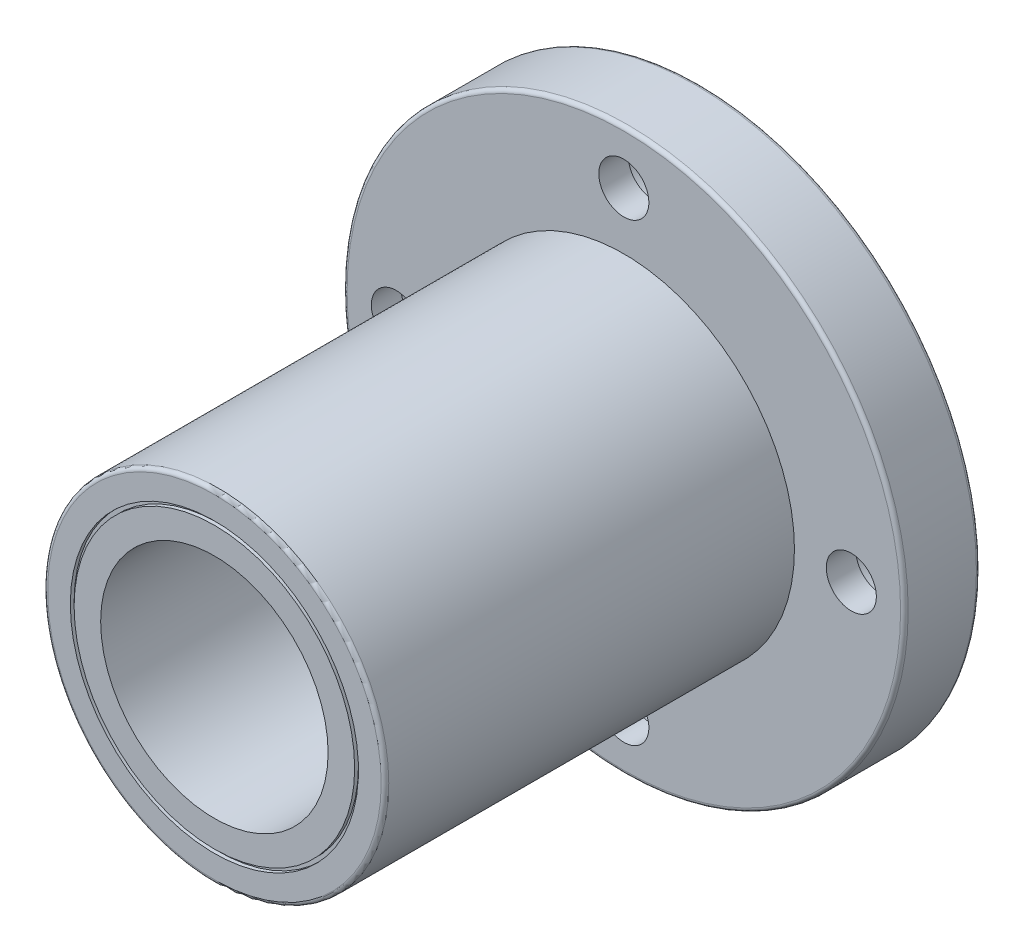
ISO-10303-21;
HEADER;
FILE_DESCRIPTION(('STEP AP214'),'2;1');
FILE_NAME('part.step','',(''),(''),'','','');
FILE_SCHEMA(('AUTOMOTIVE_DESIGN { 1 0 10303 214 1 1 1 1 }'));
ENDSEC;
DATA;
#1=APPLICATION_CONTEXT('core data for automotive mechanical design processes');
#2=APPLICATION_PROTOCOL_DEFINITION('international standard','automotive_design',2000,#1);
#3=PRODUCT_CONTEXT('',#1,'mechanical');
#4=PRODUCT('Part','Part','',(#3));
#5=PRODUCT_RELATED_PRODUCT_CATEGORY('part','',(#4));
#6=PRODUCT_DEFINITION_FORMATION('','',#4);
#7=PRODUCT_DEFINITION_CONTEXT('part definition',#1,'design');
#8=PRODUCT_DEFINITION('design','',#6,#7);
#9=PRODUCT_DEFINITION_SHAPE('','',#8);
#10=(LENGTH_UNIT() NAMED_UNIT(*) SI_UNIT(.MILLI.,.METRE.));
#11=(NAMED_UNIT(*) PLANE_ANGLE_UNIT() SI_UNIT($,.RADIAN.));
#12=(NAMED_UNIT(*) SI_UNIT($,.STERADIAN.) SOLID_ANGLE_UNIT());
#13=UNCERTAINTY_MEASURE_WITH_UNIT(LENGTH_MEASURE(1.E-05),#10,'distance_accuracy_value','');
#14=(GEOMETRIC_REPRESENTATION_CONTEXT(3) GLOBAL_UNCERTAINTY_ASSIGNED_CONTEXT((#13)) GLOBAL_UNIT_ASSIGNED_CONTEXT((#10,
#11,#12)) REPRESENTATION_CONTEXT('',''));
#15=CARTESIAN_POINT('',(0.,0.,0.));
#16=DIRECTION('',(0.,0.,1.));
#17=DIRECTION('',(1.,0.,0.));
#18=AXIS2_PLACEMENT_3D('',#15,#16,#17);
#19=CARTESIAN_POINT('',(0.,22.5,0.));
#20=DIRECTION('',(0.,0.,-1.));
#21=DIRECTION('',(-1.,0.,0.));
#22=AXIS2_PLACEMENT_3D('',#19,#20,#21);
#23=PLANE('',#22);
#24=CARTESIAN_POINT('',(0.,0.,0.));
#25=DIRECTION('',(0.,0.,-1.));
#26=DIRECTION('',(-1.,0.,0.));
#27=AXIS2_PLACEMENT_3D('',#24,#25,#26);
#28=CIRCLE('',#27,36.5);
#29=CARTESIAN_POINT('',(-36.5,0.,0.));
#30=VERTEX_POINT('',#29);
#31=EDGE_CURVE('E72',#30,#30,#28,.T.);
#32=ORIENTED_EDGE('',*,*,#31,.T.);
#33=EDGE_LOOP('',(#32));
#34=FACE_BOUND('',#33,.T.);
#35=CARTESIAN_POINT('',(0.,-30.,0.));
#36=DIRECTION('',(0.,0.,1.));
#37=DIRECTION('',(0.,1.,0.));
#38=AXIS2_PLACEMENT_3D('',#35,#36,#37);
#39=CIRCLE('',#38,5.49999999999998);
#40=CARTESIAN_POINT('',(0.,-24.5,0.));
#41=VERTEX_POINT('',#40);
#42=EDGE_CURVE('E165',#41,#41,#39,.T.);
#43=ORIENTED_EDGE('',*,*,#42,.T.);
#44=EDGE_LOOP('',(#43));
#45=FACE_BOUND('',#44,.T.);
#46=CARTESIAN_POINT('',(0.,30.,0.));
#47=DIRECTION('',(0.,0.,1.));
#48=DIRECTION('',(0.,-1.,0.));
#49=AXIS2_PLACEMENT_3D('',#46,#47,#48);
#50=CIRCLE('',#49,5.49999999999998);
#51=CARTESIAN_POINT('',(0.,24.5,0.));
#52=VERTEX_POINT('',#51);
#53=EDGE_CURVE('E133',#52,#52,#50,.T.);
#54=ORIENTED_EDGE('',*,*,#53,.T.);
#55=EDGE_LOOP('',(#54));
#56=FACE_BOUND('',#55,.T.);
#57=CARTESIAN_POINT('',(0.,0.,0.));
#58=DIRECTION('',(0.,0.,-1.));
#59=DIRECTION('',(-1.,0.,0.));
#60=AXIS2_PLACEMENT_3D('',#57,#58,#59);
#61=CIRCLE('',#60,22.5);
#62=CARTESIAN_POINT('',(-22.5,0.,0.));
#63=VERTEX_POINT('',#62);
#64=EDGE_CURVE('E129',#63,#63,#61,.T.);
#65=ORIENTED_EDGE('',*,*,#64,.F.);
#66=EDGE_LOOP('',(#65));
#67=FACE_BOUND('',#66,.T.);
#68=CARTESIAN_POINT('',(30.,-1.04744440165294E-13,0.));
#69=DIRECTION('',(0.,0.,1.));
#70=DIRECTION('',(-1.,0.,0.));
#71=AXIS2_PLACEMENT_3D('',#68,#69,#70);
#72=CIRCLE('',#71,5.49999999999998);
#73=CARTESIAN_POINT('',(24.5,0.,0.));
#74=VERTEX_POINT('',#73);
#75=EDGE_CURVE('E149',#74,#74,#72,.T.);
#76=ORIENTED_EDGE('',*,*,#75,.T.);
#77=EDGE_LOOP('',(#76));
#78=FACE_BOUND('',#77,.T.);
#79=CARTESIAN_POINT('',(-30.,3.14233320495882E-13,0.));
#80=DIRECTION('',(0.,0.,1.));
#81=DIRECTION('',(1.,0.,0.));
#82=AXIS2_PLACEMENT_3D('',#79,#80,#81);
#83=CIRCLE('',#82,5.49999999999998);
#84=CARTESIAN_POINT('',(-24.5,2.56623878404971E-13,0.));
#85=VERTEX_POINT('',#84);
#86=EDGE_CURVE('E180',#85,#85,#83,.T.);
#87=ORIENTED_EDGE('',*,*,#86,.T.);
#88=EDGE_LOOP('',(#87));
#89=FACE_BOUND('',#88,.T.);
#90=ADVANCED_FACE('F40',(#34,#45,#56,#67,#78,#89),#23,.T.);
#91=CARTESIAN_POINT('',(0.,37.,10.));
#92=DIRECTION('',(0.,0.,1.));
#93=DIRECTION('',(1.,0.,0.));
#94=AXIS2_PLACEMENT_3D('',#91,#92,#93);
#95=PLANE('',#94);
#96=CARTESIAN_POINT('',(0.,0.,10.));
#97=DIRECTION('',(0.,0.,1.));
#98=DIRECTION('',(1.,0.,0.));
#99=AXIS2_PLACEMENT_3D('',#96,#97,#98);
#100=CIRCLE('',#99,36.5);
#101=CARTESIAN_POINT('',(36.5,0.,10.));
#102=VERTEX_POINT('',#101);
#103=EDGE_CURVE('E55',#102,#102,#100,.T.);
#104=ORIENTED_EDGE('',*,*,#103,.T.);
#105=EDGE_LOOP('',(#104));
#106=FACE_BOUND('',#105,.T.);
#107=CARTESIAN_POINT('',(0.,-30.,10.));
#108=DIRECTION('',(0.,0.,1.));
#109=DIRECTION('',(0.,1.,0.));
#110=AXIS2_PLACEMENT_3D('',#107,#108,#109);
#111=CIRCLE('',#110,3.29999999999996);
#112=CARTESIAN_POINT('',(0.,-26.7000000000001,10.));
#113=VERTEX_POINT('',#112);
#114=EDGE_CURVE('E176',#113,#113,#111,.T.);
#115=ORIENTED_EDGE('',*,*,#114,.F.);
#116=EDGE_LOOP('',(#115));
#117=FACE_BOUND('',#116,.T.);
#118=CARTESIAN_POINT('',(0.,30.,10.));
#119=DIRECTION('',(0.,0.,1.));
#120=DIRECTION('',(0.,-1.,0.));
#121=AXIS2_PLACEMENT_3D('',#118,#119,#120);
#122=CIRCLE('',#121,3.29999999999996);
#123=CARTESIAN_POINT('',(0.,26.7000000000001,10.));
#124=VERTEX_POINT('',#123);
#125=EDGE_CURVE('E145',#124,#124,#122,.T.);
#126=ORIENTED_EDGE('',*,*,#125,.F.);
#127=EDGE_LOOP('',(#126));
#128=FACE_BOUND('',#127,.T.);
#129=CARTESIAN_POINT('',(0.,0.,9.99999999999999));
#130=DIRECTION('',(0.,0.,-1.));
#131=DIRECTION('',(-1.,0.,0.));
#132=AXIS2_PLACEMENT_3D('',#129,#130,#131);
#133=CIRCLE('',#132,22.5);
#134=CARTESIAN_POINT('',(-22.5,0.,9.99999999999999));
#135=VERTEX_POINT('',#134);
#136=EDGE_CURVE('E76',#135,#135,#133,.T.);
#137=ORIENTED_EDGE('',*,*,#136,.T.);
#138=EDGE_LOOP('',(#137));
#139=FACE_BOUND('',#138,.T.);
#140=CARTESIAN_POINT('',(30.,-1.04744440165294E-13,10.));
#141=DIRECTION('',(0.,0.,1.));
#142=DIRECTION('',(-1.,0.,0.));
#143=AXIS2_PLACEMENT_3D('',#140,#141,#142);
#144=CIRCLE('',#143,3.29999999999996);
#145=CARTESIAN_POINT('',(26.7000000000001,0.,10.));
#146=VERTEX_POINT('',#145);
#147=EDGE_CURVE('E161',#146,#146,#144,.T.);
#148=ORIENTED_EDGE('',*,*,#147,.F.);
#149=EDGE_LOOP('',(#148));
#150=FACE_BOUND('',#149,.T.);
#151=CARTESIAN_POINT('',(-30.,3.14233320495882E-13,10.));
#152=DIRECTION('',(0.,0.,1.));
#153=DIRECTION('',(1.,0.,0.));
#154=AXIS2_PLACEMENT_3D('',#151,#152,#153);
#155=CIRCLE('',#154,3.29999999999996);
#156=CARTESIAN_POINT('',(-26.7000000000001,2.79667655241336E-13,10.));
#157=VERTEX_POINT('',#156);
#158=EDGE_CURVE('E192',#157,#157,#155,.T.);
#159=ORIENTED_EDGE('',*,*,#158,.F.);
#160=EDGE_LOOP('',(#159));
#161=FACE_BOUND('',#160,.T.);
#162=ADVANCED_FACE('F200',(#106,#117,#128,#139,#150,#161),#95,.T.);
#163=CARTESIAN_POINT('',(0.,0.,0.));
#164=DIRECTION('',(0.,0.,-1.));
#165=DIRECTION('',(-1.,0.,0.));
#166=AXIS2_PLACEMENT_3D('',#163,#164,#165);
#167=CYLINDRICAL_SURFACE('',#166,37.);
#168=CARTESIAN_POINT('',(0.,0.,0.500000000000001));
#169=DIRECTION('',(0.,0.,-1.));
#170=DIRECTION('',(-1.,0.,0.));
#171=AXIS2_PLACEMENT_3D('',#168,#169,#170);
#172=CIRCLE('',#171,37.);
#173=CARTESIAN_POINT('',(-37.,0.,0.500000000000001));
#174=VERTEX_POINT('',#173);
#175=EDGE_CURVE('E62',#174,#174,#172,.F.);
#176=ORIENTED_EDGE('',*,*,#175,.T.);
#177=EDGE_LOOP('',(#176));
#178=FACE_BOUND('',#177,.T.);
#179=CARTESIAN_POINT('',(0.,0.,9.5));
#180=DIRECTION('',(0.,0.,1.));
#181=DIRECTION('',(1.,0.,0.));
#182=AXIS2_PLACEMENT_3D('',#179,#180,#181);
#183=CIRCLE('',#182,37.);
#184=CARTESIAN_POINT('',(37.,0.,9.5));
#185=VERTEX_POINT('',#184);
#186=EDGE_CURVE('E68',#185,#185,#183,.F.);
#187=ORIENTED_EDGE('',*,*,#186,.T.);
#188=EDGE_LOOP('',(#187));
#189=FACE_BOUND('',#188,.T.);
#190=ADVANCED_FACE('F202',(#178,#189),#167,.T.);
#191=CARTESIAN_POINT('',(0.,0.,0.));
#192=DIRECTION('',(0.,0.,-1.));
#193=DIRECTION('',(-1.,0.,0.));
#194=AXIS2_PLACEMENT_3D('',#191,#192,#193);
#195=CYLINDRICAL_SURFACE('',#194,22.5);
#196=CARTESIAN_POINT('',(0.,0.,63.5));
#197=DIRECTION('',(0.,0.,1.));
#198=DIRECTION('',(1.,0.,0.));
#199=AXIS2_PLACEMENT_3D('',#196,#197,#198);
#200=CIRCLE('',#199,22.5);
#201=CARTESIAN_POINT('',(22.5,0.,63.5));
#202=VERTEX_POINT('',#201);
#203=EDGE_CURVE('E48',#202,#202,#200,.F.);
#204=ORIENTED_EDGE('',*,*,#203,.T.);
#205=EDGE_LOOP('',(#204));
#206=FACE_BOUND('',#205,.T.);
#207=ORIENTED_EDGE('',*,*,#136,.F.);
#208=EDGE_LOOP('',(#207));
#209=FACE_BOUND('',#208,.T.);
#210=ADVANCED_FACE('F209',(#206,#209),#195,.T.);
#211=CARTESIAN_POINT('',(0.,22.5,64.));
#212=DIRECTION('',(0.,0.,1.));
#213=DIRECTION('',(1.,0.,0.));
#214=AXIS2_PLACEMENT_3D('',#211,#212,#213);
#215=PLANE('',#214);
#216=CARTESIAN_POINT('',(0.,0.,64.));
#217=DIRECTION('',(0.,0.,1.));
#218=DIRECTION('',(1.,0.,0.));
#219=AXIS2_PLACEMENT_3D('',#216,#217,#218);
#220=CIRCLE('',#219,22.);
#221=CARTESIAN_POINT('',(22.,0.,64.));
#222=VERTEX_POINT('',#221);
#223=EDGE_CURVE('E10',#222,#222,#220,.T.);
#224=ORIENTED_EDGE('',*,*,#223,.T.);
#225=EDGE_LOOP('',(#224));
#226=FACE_BOUND('',#225,.T.);
#227=CARTESIAN_POINT('',(0.,0.,64.));
#228=DIRECTION('',(0.,0.,-1.));
#229=DIRECTION('',(-1.,0.,0.));
#230=AXIS2_PLACEMENT_3D('',#227,#228,#229);
#231=CIRCLE('',#230,19.);
#232=CARTESIAN_POINT('',(-19.,0.,64.));
#233=VERTEX_POINT('',#232);
#234=EDGE_CURVE('E80',#233,#233,#231,.T.);
#235=ORIENTED_EDGE('',*,*,#234,.T.);
#236=EDGE_LOOP('',(#235));
#237=FACE_BOUND('',#236,.T.);
#238=ADVANCED_FACE('F466',(#226,#237),#215,.T.);
#239=CARTESIAN_POINT('',(0.,0.,0.));
#240=DIRECTION('',(0.,0.,-1.));
#241=DIRECTION('',(-1.,0.,0.));
#242=AXIS2_PLACEMENT_3D('',#239,#240,#241);
#243=CYLINDRICAL_SURFACE('',#242,19.);
#244=CARTESIAN_POINT('',(0.,0.,63.5));
#245=DIRECTION('',(0.,0.,-1.));
#246=DIRECTION('',(-1.,0.,0.));
#247=AXIS2_PLACEMENT_3D('',#244,#245,#246);
#248=CIRCLE('',#247,19.);
#249=CARTESIAN_POINT('',(-19.,0.,63.5));
#250=VERTEX_POINT('',#249);
#251=EDGE_CURVE('E84',#250,#250,#248,.T.);
#252=ORIENTED_EDGE('',*,*,#251,.T.);
#253=EDGE_LOOP('',(#252));
#254=FACE_BOUND('',#253,.T.);
#255=ORIENTED_EDGE('',*,*,#234,.F.);
#256=EDGE_LOOP('',(#255));
#257=FACE_BOUND('',#256,.T.);
#258=ADVANCED_FACE('F457',(#254,#257),#243,.F.);
#259=CARTESIAN_POINT('',(0.,19.,63.5));
#260=DIRECTION('',(0.,0.,1.));
#261=DIRECTION('',(1.,0.,0.));
#262=AXIS2_PLACEMENT_3D('',#259,#260,#261);
#263=PLANE('',#262);
#264=CARTESIAN_POINT('',(0.,0.,63.5));
#265=DIRECTION('',(0.,0.,-1.));
#266=DIRECTION('',(-1.,0.,0.));
#267=AXIS2_PLACEMENT_3D('',#264,#265,#266);
#268=CIRCLE('',#267,18.5);
#269=CARTESIAN_POINT('',(-18.5,0.,63.5));
#270=VERTEX_POINT('',#269);
#271=EDGE_CURVE('E88',#270,#270,#268,.T.);
#272=ORIENTED_EDGE('',*,*,#271,.T.);
#273=EDGE_LOOP('',(#272));
#274=FACE_BOUND('',#273,.T.);
#275=ORIENTED_EDGE('',*,*,#251,.F.);
#276=EDGE_LOOP('',(#275));
#277=FACE_BOUND('',#276,.T.);
#278=ADVANCED_FACE('F448',(#274,#277),#263,.T.);
#279=CARTESIAN_POINT('',(0.,0.,0.));
#280=DIRECTION('',(0.,0.,-1.));
#281=DIRECTION('',(-1.,0.,0.));
#282=AXIS2_PLACEMENT_3D('',#279,#280,#281);
#283=CYLINDRICAL_SURFACE('',#282,18.5);
#284=CARTESIAN_POINT('',(0.,0.,64.));
#285=DIRECTION('',(0.,0.,-1.));
#286=DIRECTION('',(-1.,0.,0.));
#287=AXIS2_PLACEMENT_3D('',#284,#285,#286);
#288=CIRCLE('',#287,18.5);
#289=CARTESIAN_POINT('',(-18.5,0.,64.));
#290=VERTEX_POINT('',#289);
#291=EDGE_CURVE('E92',#290,#290,#288,.T.);
#292=ORIENTED_EDGE('',*,*,#291,.T.);
#293=EDGE_LOOP('',(#292));
#294=FACE_BOUND('',#293,.T.);
#295=ORIENTED_EDGE('',*,*,#271,.F.);
#296=EDGE_LOOP('',(#295));
#297=FACE_BOUND('',#296,.T.);
#298=ADVANCED_FACE('F440',(#294,#297),#283,.T.);
#299=CARTESIAN_POINT('',(0.,18.5,64.));
#300=DIRECTION('',(0.,0.,1.));
#301=DIRECTION('',(1.,0.,0.));
#302=AXIS2_PLACEMENT_3D('',#299,#300,#301);
#303=PLANE('',#302);
#304=CARTESIAN_POINT('',(0.,0.,64.));
#305=DIRECTION('',(0.,0.,-1.));
#306=DIRECTION('',(-1.,0.,0.));
#307=AXIS2_PLACEMENT_3D('',#304,#305,#306);
#308=CIRCLE('',#307,15.);
#309=CARTESIAN_POINT('',(-15.,0.,64.));
#310=VERTEX_POINT('',#309);
#311=EDGE_CURVE('E96',#310,#310,#308,.T.);
#312=ORIENTED_EDGE('',*,*,#311,.T.);
#313=EDGE_LOOP('',(#312));
#314=FACE_BOUND('',#313,.T.);
#315=ORIENTED_EDGE('',*,*,#291,.F.);
#316=EDGE_LOOP('',(#315));
#317=FACE_BOUND('',#316,.T.);
#318=ADVANCED_FACE('F432',(#314,#317),#303,.T.);
#319=CARTESIAN_POINT('',(0.,0.,0.));
#320=DIRECTION('',(0.,0.,-1.));
#321=DIRECTION('',(-1.,0.,0.));
#322=AXIS2_PLACEMENT_3D('',#319,#320,#321);
#323=CYLINDRICAL_SURFACE('',#322,15.);
#324=CARTESIAN_POINT('',(0.,0.,0.));
#325=DIRECTION('',(0.,0.,-1.));
#326=DIRECTION('',(-1.,0.,0.));
#327=AXIS2_PLACEMENT_3D('',#324,#325,#326);
#328=CIRCLE('',#327,15.);
#329=CARTESIAN_POINT('',(-15.,0.,0.));
#330=VERTEX_POINT('',#329);
#331=EDGE_CURVE('E100',#330,#330,#328,.T.);
#332=ORIENTED_EDGE('',*,*,#331,.T.);
#333=EDGE_LOOP('',(#332));
#334=FACE_BOUND('',#333,.T.);
#335=ORIENTED_EDGE('',*,*,#311,.F.);
#336=EDGE_LOOP('',(#335));
#337=FACE_BOUND('',#336,.T.);
#338=ADVANCED_FACE('F423',(#334,#337),#323,.F.);
#339=CARTESIAN_POINT('',(0.,15.,0.));
#340=DIRECTION('',(0.,0.,-1.));
#341=DIRECTION('',(-1.,0.,0.));
#342=AXIS2_PLACEMENT_3D('',#339,#340,#341);
#343=PLANE('',#342);
#344=CARTESIAN_POINT('',(0.,0.,0.));
#345=DIRECTION('',(0.,0.,-1.));
#346=DIRECTION('',(-1.,0.,0.));
#347=AXIS2_PLACEMENT_3D('',#344,#345,#346);
#348=CIRCLE('',#347,18.5);
#349=CARTESIAN_POINT('',(-18.5,0.,0.));
#350=VERTEX_POINT('',#349);
#351=EDGE_CURVE('E104',#350,#350,#348,.T.);
#352=ORIENTED_EDGE('',*,*,#351,.T.);
#353=EDGE_LOOP('',(#352));
#354=FACE_BOUND('',#353,.T.);
#355=ORIENTED_EDGE('',*,*,#331,.F.);
#356=EDGE_LOOP('',(#355));
#357=FACE_BOUND('',#356,.T.);
#358=ADVANCED_FACE('F414',(#354,#357),#343,.T.);
#359=CARTESIAN_POINT('',(0.,0.,0.));
#360=DIRECTION('',(0.,0.,-1.));
#361=DIRECTION('',(-1.,0.,0.));
#362=AXIS2_PLACEMENT_3D('',#359,#360,#361);
#363=CYLINDRICAL_SURFACE('',#362,18.5);
#364=CARTESIAN_POINT('',(0.,0.,0.5));
#365=DIRECTION('',(0.,0.,-1.));
#366=DIRECTION('',(-1.,0.,0.));
#367=AXIS2_PLACEMENT_3D('',#364,#365,#366);
#368=CIRCLE('',#367,18.5);
#369=CARTESIAN_POINT('',(-18.5,0.,0.5));
#370=VERTEX_POINT('',#369);
#371=EDGE_CURVE('E108',#370,#370,#368,.T.);
#372=ORIENTED_EDGE('',*,*,#371,.T.);
#373=EDGE_LOOP('',(#372));
#374=FACE_BOUND('',#373,.T.);
#375=ORIENTED_EDGE('',*,*,#351,.F.);
#376=EDGE_LOOP('',(#375));
#377=FACE_BOUND('',#376,.T.);
#378=ADVANCED_FACE('F405',(#374,#377),#363,.T.);
#379=CARTESIAN_POINT('',(0.,19.,0.5));
#380=DIRECTION('',(0.,0.,-1.));
#381=DIRECTION('',(-1.,0.,0.));
#382=AXIS2_PLACEMENT_3D('',#379,#380,#381);
#383=PLANE('',#382);
#384=CARTESIAN_POINT('',(0.,0.,0.5));
#385=DIRECTION('',(0.,0.,-1.));
#386=DIRECTION('',(-1.,0.,0.));
#387=AXIS2_PLACEMENT_3D('',#384,#385,#386);
#388=CIRCLE('',#387,19.);
#389=CARTESIAN_POINT('',(-19.,0.,0.5));
#390=VERTEX_POINT('',#389);
#391=EDGE_CURVE('E111',#390,#390,#388,.T.);
#392=ORIENTED_EDGE('',*,*,#391,.T.);
#393=EDGE_LOOP('',(#392));
#394=FACE_BOUND('',#393,.T.);
#395=ORIENTED_EDGE('',*,*,#371,.F.);
#396=EDGE_LOOP('',(#395));
#397=FACE_BOUND('',#396,.T.);
#398=ADVANCED_FACE('F396',(#394,#397),#383,.T.);
#399=CARTESIAN_POINT('',(0.,0.,0.));
#400=DIRECTION('',(0.,0.,-1.));
#401=DIRECTION('',(-1.,0.,0.));
#402=AXIS2_PLACEMENT_3D('',#399,#400,#401);
#403=CYLINDRICAL_SURFACE('',#402,19.);
#404=CARTESIAN_POINT('',(0.,0.,0.));
#405=DIRECTION('',(0.,0.,-1.));
#406=DIRECTION('',(-1.,0.,0.));
#407=AXIS2_PLACEMENT_3D('',#404,#405,#406);
#408=CIRCLE('',#407,19.);
#409=CARTESIAN_POINT('',(-19.,0.,0.));
#410=VERTEX_POINT('',#409);
#411=EDGE_CURVE('E115',#410,#410,#408,.T.);
#412=ORIENTED_EDGE('',*,*,#411,.T.);
#413=EDGE_LOOP('',(#412));
#414=FACE_BOUND('',#413,.T.);
#415=ORIENTED_EDGE('',*,*,#391,.F.);
#416=EDGE_LOOP('',(#415));
#417=FACE_BOUND('',#416,.T.);
#418=ADVANCED_FACE('F387',(#414,#417),#403,.F.);
#419=CARTESIAN_POINT('',(0.,19.,0.));
#420=DIRECTION('',(0.,0.,-1.));
#421=DIRECTION('',(-1.,0.,0.));
#422=AXIS2_PLACEMENT_3D('',#419,#420,#421);
#423=PLANE('',#422);
#424=CARTESIAN_POINT('',(0.,0.,0.));
#425=DIRECTION('',(0.,0.,-1.));
#426=DIRECTION('',(-1.,0.,0.));
#427=AXIS2_PLACEMENT_3D('',#424,#425,#426);
#428=CIRCLE('',#427,22.);
#429=CARTESIAN_POINT('',(-22.,0.,0.));
#430=VERTEX_POINT('',#429);
#431=EDGE_CURVE('E119',#430,#430,#428,.T.);
#432=ORIENTED_EDGE('',*,*,#431,.T.);
#433=EDGE_LOOP('',(#432));
#434=FACE_BOUND('',#433,.T.);
#435=ORIENTED_EDGE('',*,*,#411,.F.);
#436=EDGE_LOOP('',(#435));
#437=FACE_BOUND('',#436,.T.);
#438=ADVANCED_FACE('F378',(#434,#437),#423,.T.);
#439=CARTESIAN_POINT('',(0.,0.,0.));
#440=DIRECTION('',(0.,0.,-1.));
#441=DIRECTION('',(-1.,0.,0.));
#442=AXIS2_PLACEMENT_3D('',#439,#440,#441);
#443=CYLINDRICAL_SURFACE('',#442,22.);
#444=CARTESIAN_POINT('',(0.,0.,0.500000000000001));
#445=DIRECTION('',(0.,0.,-1.));
#446=DIRECTION('',(-1.,0.,0.));
#447=AXIS2_PLACEMENT_3D('',#444,#445,#446);
#448=CIRCLE('',#447,22.);
#449=CARTESIAN_POINT('',(-22.,0.,0.500000000000001));
#450=VERTEX_POINT('',#449);
#451=EDGE_CURVE('E122',#450,#450,#448,.T.);
#452=ORIENTED_EDGE('',*,*,#451,.T.);
#453=EDGE_LOOP('',(#452));
#454=FACE_BOUND('',#453,.T.);
#455=ORIENTED_EDGE('',*,*,#431,.F.);
#456=EDGE_LOOP('',(#455));
#457=FACE_BOUND('',#456,.T.);
#458=ADVANCED_FACE('F369',(#454,#457),#443,.T.);
#459=CARTESIAN_POINT('',(0.,22.5,0.500000000000001));
#460=DIRECTION('',(0.,0.,-1.));
#461=DIRECTION('',(-1.,0.,0.));
#462=AXIS2_PLACEMENT_3D('',#459,#460,#461);
#463=PLANE('',#462);
#464=CARTESIAN_POINT('',(0.,0.,0.500000000000001));
#465=DIRECTION('',(0.,0.,-1.));
#466=DIRECTION('',(-1.,0.,0.));
#467=AXIS2_PLACEMENT_3D('',#464,#465,#466);
#468=CIRCLE('',#467,22.5);
#469=CARTESIAN_POINT('',(-22.5,0.,0.500000000000001));
#470=VERTEX_POINT('',#469);
#471=EDGE_CURVE('E125',#470,#470,#468,.T.);
#472=ORIENTED_EDGE('',*,*,#471,.T.);
#473=EDGE_LOOP('',(#472));
#474=FACE_BOUND('',#473,.T.);
#475=ORIENTED_EDGE('',*,*,#451,.F.);
#476=EDGE_LOOP('',(#475));
#477=FACE_BOUND('',#476,.T.);
#478=ADVANCED_FACE('F360',(#474,#477),#463,.T.);
#479=CARTESIAN_POINT('',(0.,0.,0.));
#480=DIRECTION('',(0.,0.,-1.));
#481=DIRECTION('',(-1.,0.,0.));
#482=AXIS2_PLACEMENT_3D('',#479,#480,#481);
#483=CYLINDRICAL_SURFACE('',#482,22.5);
#484=ORIENTED_EDGE('',*,*,#64,.T.);
#485=EDGE_LOOP('',(#484));
#486=FACE_BOUND('',#485,.T.);
#487=ORIENTED_EDGE('',*,*,#471,.F.);
#488=EDGE_LOOP('',(#487));
#489=FACE_BOUND('',#488,.T.);
#490=ADVANCED_FACE('F351',(#486,#489),#483,.F.);
#491=CARTESIAN_POINT('',(0.,30.,0.));
#492=DIRECTION('',(0.,0.,1.));
#493=DIRECTION('',(0.,-1.,0.));
#494=AXIS2_PLACEMENT_3D('',#491,#492,#493);
#495=CYLINDRICAL_SURFACE('',#494,5.49999999999997);
#496=CARTESIAN_POINT('',(0.,30.,6.10000000000002));
#497=DIRECTION('',(0.,0.,1.));
#498=DIRECTION('',(0.,-1.,0.));
#499=AXIS2_PLACEMENT_3D('',#496,#497,#498);
#500=CIRCLE('',#499,5.49999999999997);
#501=CARTESIAN_POINT('',(0.,24.5000000000001,6.10000000000003));
#502=VERTEX_POINT('',#501);
#503=EDGE_CURVE('E137',#502,#502,#500,.T.);
#504=ORIENTED_EDGE('',*,*,#503,.T.);
#505=EDGE_LOOP('',(#504));
#506=FACE_BOUND('',#505,.T.);
#507=ORIENTED_EDGE('',*,*,#53,.F.);
#508=EDGE_LOOP('',(#507));
#509=FACE_BOUND('',#508,.T.);
#510=ADVANCED_FACE('F342',(#506,#509),#495,.F.);
#511=CARTESIAN_POINT('',(0.,35.5,6.1));
#512=DIRECTION('',(0.,0.,-1.));
#513=DIRECTION('',(0.,1.,0.));
#514=AXIS2_PLACEMENT_3D('',#511,#512,#513);
#515=PLANE('',#514);
#516=CARTESIAN_POINT('',(0.,30.,6.10000000000001));
#517=DIRECTION('',(0.,0.,1.));
#518=DIRECTION('',(0.,-1.,0.));
#519=AXIS2_PLACEMENT_3D('',#516,#517,#518);
#520=CIRCLE('',#519,3.29999999999997);
#521=CARTESIAN_POINT('',(0.,26.7,6.10000000000002));
#522=VERTEX_POINT('',#521);
#523=EDGE_CURVE('E141',#522,#522,#520,.T.);
#524=ORIENTED_EDGE('',*,*,#523,.T.);
#525=EDGE_LOOP('',(#524));
#526=FACE_BOUND('',#525,.T.);
#527=ORIENTED_EDGE('',*,*,#503,.F.);
#528=EDGE_LOOP('',(#527));
#529=FACE_BOUND('',#528,.T.);
#530=ADVANCED_FACE('F333',(#526,#529),#515,.T.);
#531=CARTESIAN_POINT('',(0.,30.,0.));
#532=DIRECTION('',(0.,0.,1.));
#533=DIRECTION('',(0.,-1.,0.));
#534=AXIS2_PLACEMENT_3D('',#531,#532,#533);
#535=CYLINDRICAL_SURFACE('',#534,3.29999999999997);
#536=ORIENTED_EDGE('',*,*,#125,.T.);
#537=EDGE_LOOP('',(#536));
#538=FACE_BOUND('',#537,.T.);
#539=ORIENTED_EDGE('',*,*,#523,.F.);
#540=EDGE_LOOP('',(#539));
#541=FACE_BOUND('',#540,.T.);
#542=ADVANCED_FACE('F324',(#538,#541),#535,.F.);
#543=CARTESIAN_POINT('',(30.,-1.04744440165294E-13,0.));
#544=DIRECTION('',(0.,0.,1.));
#545=DIRECTION('',(-1.,0.,0.));
#546=AXIS2_PLACEMENT_3D('',#543,#544,#545);
#547=CYLINDRICAL_SURFACE('',#546,5.49999999999997);
#548=CARTESIAN_POINT('',(30.,-1.04744440165294E-13,6.10000000000002));
#549=DIRECTION('',(0.,0.,1.));
#550=DIRECTION('',(-1.,0.,0.));
#551=AXIS2_PLACEMENT_3D('',#548,#549,#550);
#552=CIRCLE('',#551,5.49999999999997);
#553=CARTESIAN_POINT('',(24.5000000000001,0.,6.10000000000003));
#554=VERTEX_POINT('',#553);
#555=EDGE_CURVE('E153',#554,#554,#552,.T.);
#556=ORIENTED_EDGE('',*,*,#555,.T.);
#557=EDGE_LOOP('',(#556));
#558=FACE_BOUND('',#557,.T.);
#559=ORIENTED_EDGE('',*,*,#75,.F.);
#560=EDGE_LOOP('',(#559));
#561=FACE_BOUND('',#560,.T.);
#562=ADVANCED_FACE('F316',(#558,#561),#547,.F.);
#563=CARTESIAN_POINT('',(35.5,-1.23947587528931E-13,6.1));
#564=DIRECTION('',(0.,0.,-1.));
#565=DIRECTION('',(1.,0.,0.));
#566=AXIS2_PLACEMENT_3D('',#563,#564,#565);
#567=PLANE('',#566);
#568=CARTESIAN_POINT('',(30.,-1.04744440165294E-13,6.10000000000001));
#569=DIRECTION('',(0.,0.,1.));
#570=DIRECTION('',(-1.,0.,0.));
#571=AXIS2_PLACEMENT_3D('',#568,#569,#570);
#572=CIRCLE('',#571,3.29999999999997);
#573=CARTESIAN_POINT('',(26.7,0.,6.10000000000002));
#574=VERTEX_POINT('',#573);
#575=EDGE_CURVE('E157',#574,#574,#572,.T.);
#576=ORIENTED_EDGE('',*,*,#575,.T.);
#577=EDGE_LOOP('',(#576));
#578=FACE_BOUND('',#577,.T.);
#579=ORIENTED_EDGE('',*,*,#555,.F.);
#580=EDGE_LOOP('',(#579));
#581=FACE_BOUND('',#580,.T.);
#582=ADVANCED_FACE('F308',(#578,#581),#567,.T.);
#583=CARTESIAN_POINT('',(30.,-1.04744440165294E-13,0.));
#584=DIRECTION('',(0.,0.,1.));
#585=DIRECTION('',(-1.,0.,0.));
#586=AXIS2_PLACEMENT_3D('',#583,#584,#585);
#587=CYLINDRICAL_SURFACE('',#586,3.29999999999997);
#588=ORIENTED_EDGE('',*,*,#147,.T.);
#589=EDGE_LOOP('',(#588));
#590=FACE_BOUND('',#589,.T.);
#591=ORIENTED_EDGE('',*,*,#575,.F.);
#592=EDGE_LOOP('',(#591));
#593=FACE_BOUND('',#592,.T.);
#594=ADVANCED_FACE('F300',(#590,#593),#587,.F.);
#595=CARTESIAN_POINT('',(0.,-30.,0.));
#596=DIRECTION('',(0.,0.,1.));
#597=DIRECTION('',(0.,1.,0.));
#598=AXIS2_PLACEMENT_3D('',#595,#596,#597);
#599=CYLINDRICAL_SURFACE('',#598,5.49999999999997);
#600=CARTESIAN_POINT('',(0.,-30.,6.10000000000002));
#601=DIRECTION('',(0.,0.,1.));
#602=DIRECTION('',(0.,1.,0.));
#603=AXIS2_PLACEMENT_3D('',#600,#601,#602);
#604=CIRCLE('',#603,5.49999999999997);
#605=CARTESIAN_POINT('',(0.,-24.5000000000001,6.10000000000003));
#606=VERTEX_POINT('',#605);
#607=EDGE_CURVE('E169',#606,#606,#604,.T.);
#608=ORIENTED_EDGE('',*,*,#607,.T.);
#609=EDGE_LOOP('',(#608));
#610=FACE_BOUND('',#609,.T.);
#611=ORIENTED_EDGE('',*,*,#42,.F.);
#612=EDGE_LOOP('',(#611));
#613=FACE_BOUND('',#612,.T.);
#614=ADVANCED_FACE('F292',(#610,#613),#599,.F.);
#615=CARTESIAN_POINT('',(0.,-35.5,6.1));
#616=DIRECTION('',(0.,0.,-1.));
#617=DIRECTION('',(0.,-1.,0.));
#618=AXIS2_PLACEMENT_3D('',#615,#616,#617);
#619=PLANE('',#618);
#620=CARTESIAN_POINT('',(0.,-30.,6.10000000000001));
#621=DIRECTION('',(0.,0.,1.));
#622=DIRECTION('',(0.,1.,0.));
#623=AXIS2_PLACEMENT_3D('',#620,#621,#622);
#624=CIRCLE('',#623,3.29999999999997);
#625=CARTESIAN_POINT('',(0.,-26.7,6.10000000000002));
#626=VERTEX_POINT('',#625);
#627=EDGE_CURVE('E173',#626,#626,#624,.T.);
#628=ORIENTED_EDGE('',*,*,#627,.T.);
#629=EDGE_LOOP('',(#628));
#630=FACE_BOUND('',#629,.T.);
#631=ORIENTED_EDGE('',*,*,#607,.F.);
#632=EDGE_LOOP('',(#631));
#633=FACE_BOUND('',#632,.T.);
#634=ADVANCED_FACE('F283',(#630,#633),#619,.T.);
#635=CARTESIAN_POINT('',(0.,-30.,0.));
#636=DIRECTION('',(0.,0.,1.));
#637=DIRECTION('',(0.,1.,0.));
#638=AXIS2_PLACEMENT_3D('',#635,#636,#637);
#639=CYLINDRICAL_SURFACE('',#638,3.29999999999997);
#640=ORIENTED_EDGE('',*,*,#114,.T.);
#641=EDGE_LOOP('',(#640));
#642=FACE_BOUND('',#641,.T.);
#643=ORIENTED_EDGE('',*,*,#627,.F.);
#644=EDGE_LOOP('',(#643));
#645=FACE_BOUND('',#644,.T.);
#646=ADVANCED_FACE('F272',(#642,#645),#639,.F.);
#647=CARTESIAN_POINT('',(-30.,3.14233320495882E-13,0.));
#648=DIRECTION('',(0.,0.,1.));
#649=DIRECTION('',(1.,0.,0.));
#650=AXIS2_PLACEMENT_3D('',#647,#648,#649);
#651=CYLINDRICAL_SURFACE('',#650,5.49999999999997);
#652=CARTESIAN_POINT('',(-30.,3.14233320495882E-13,6.10000000000002));
#653=DIRECTION('',(0.,0.,1.));
#654=DIRECTION('',(1.,0.,0.));
#655=AXIS2_PLACEMENT_3D('',#652,#653,#654);
#656=CIRCLE('',#655,5.49999999999997);
#657=CARTESIAN_POINT('',(-24.5000000000001,2.56623878404971E-13,6.10000000000003));
#658=VERTEX_POINT('',#657);
#659=EDGE_CURVE('E184',#658,#658,#656,.T.);
#660=ORIENTED_EDGE('',*,*,#659,.T.);
#661=EDGE_LOOP('',(#660));
#662=FACE_BOUND('',#661,.T.);
#663=ORIENTED_EDGE('',*,*,#86,.F.);
#664=EDGE_LOOP('',(#663));
#665=FACE_BOUND('',#664,.T.);
#666=ADVANCED_FACE('F261',(#662,#665),#651,.F.);
#667=CARTESIAN_POINT('',(-35.5,3.71842762586794E-13,6.1));
#668=DIRECTION('',(0.,0.,-1.));
#669=DIRECTION('',(-1.,0.,0.));
#670=AXIS2_PLACEMENT_3D('',#667,#668,#669);
#671=PLANE('',#670);
#672=CARTESIAN_POINT('',(-30.,3.14233320495882E-13,6.10000000000001));
#673=DIRECTION('',(0.,0.,1.));
#674=DIRECTION('',(1.,0.,0.));
#675=AXIS2_PLACEMENT_3D('',#672,#673,#674);
#676=CIRCLE('',#675,3.29999999999997);
#677=CARTESIAN_POINT('',(-26.7,2.79667655241336E-13,6.10000000000002));
#678=VERTEX_POINT('',#677);
#679=EDGE_CURVE('E188',#678,#678,#676,.T.);
#680=ORIENTED_EDGE('',*,*,#679,.T.);
#681=EDGE_LOOP('',(#680));
#682=FACE_BOUND('',#681,.T.);
#683=ORIENTED_EDGE('',*,*,#659,.F.);
#684=EDGE_LOOP('',(#683));
#685=FACE_BOUND('',#684,.T.);
#686=ADVANCED_FACE('F251',(#682,#685),#671,.T.);
#687=CARTESIAN_POINT('',(-30.,3.14233320495882E-13,0.));
#688=DIRECTION('',(0.,0.,1.));
#689=DIRECTION('',(1.,0.,0.));
#690=AXIS2_PLACEMENT_3D('',#687,#688,#689);
#691=CYLINDRICAL_SURFACE('',#690,3.29999999999997);
#692=ORIENTED_EDGE('',*,*,#158,.T.);
#693=EDGE_LOOP('',(#692));
#694=FACE_BOUND('',#693,.T.);
#695=ORIENTED_EDGE('',*,*,#679,.F.);
#696=EDGE_LOOP('',(#695));
#697=FACE_BOUND('',#696,.T.);
#698=ADVANCED_FACE('F197',(#694,#697),#691,.F.);
#699=CARTESIAN_POINT('',(0.,0.,0.500000000000001));
#700=DIRECTION('',(0.,0.,-1.));
#701=DIRECTION('',(-1.,0.,0.));
#702=AXIS2_PLACEMENT_3D('',#699,#700,#701);
#703=TOROIDAL_SURFACE('',#702,36.5,0.5);
#704=ORIENTED_EDGE('',*,*,#175,.F.);
#705=EDGE_LOOP('',(#704));
#706=FACE_BOUND('',#705,.T.);
#707=ORIENTED_EDGE('',*,*,#31,.F.);
#708=EDGE_LOOP('',(#707));
#709=FACE_BOUND('',#708,.T.);
#710=ADVANCED_FACE('F218',(#706,#709),#703,.T.);
#711=CARTESIAN_POINT('',(0.,0.,9.5));
#712=DIRECTION('',(0.,0.,1.));
#713=DIRECTION('',(1.,0.,0.));
#714=AXIS2_PLACEMENT_3D('',#711,#712,#713);
#715=TOROIDAL_SURFACE('',#714,36.5,0.5);
#716=ORIENTED_EDGE('',*,*,#103,.F.);
#717=EDGE_LOOP('',(#716));
#718=FACE_BOUND('',#717,.T.);
#719=ORIENTED_EDGE('',*,*,#186,.F.);
#720=EDGE_LOOP('',(#719));
#721=FACE_BOUND('',#720,.T.);
#722=ADVANCED_FACE('F220',(#718,#721),#715,.T.);
#723=CARTESIAN_POINT('',(0.,0.,63.5));
#724=DIRECTION('',(0.,0.,1.));
#725=DIRECTION('',(1.,0.,0.));
#726=AXIS2_PLACEMENT_3D('',#723,#724,#725);
#727=TOROIDAL_SURFACE('',#726,22.,0.5);
#728=ORIENTED_EDGE('',*,*,#223,.F.);
#729=EDGE_LOOP('',(#728));
#730=FACE_BOUND('',#729,.T.);
#731=ORIENTED_EDGE('',*,*,#203,.F.);
#732=EDGE_LOOP('',(#731));
#733=FACE_BOUND('',#732,.T.);
#734=ADVANCED_FACE('F42',(#730,#733),#727,.T.);
#735=CLOSED_SHELL('',(#90,#162,#190,#210,#238,#258,#278,#298,#318,#338,#358,#378,#398,#418,#438,
#458,#478,#490,#510,#530,#542,#562,#582,#594,#614,#634,#646,#666,#686,#698,#710,#722,#734));
#736=MANIFOLD_SOLID_BREP('B2',#735);
#737=ADVANCED_BREP_SHAPE_REPRESENTATION('',(#18,#736),#14);
#738=SHAPE_DEFINITION_REPRESENTATION(#9,#737);
ENDSEC;
END-ISO-10303-21;
